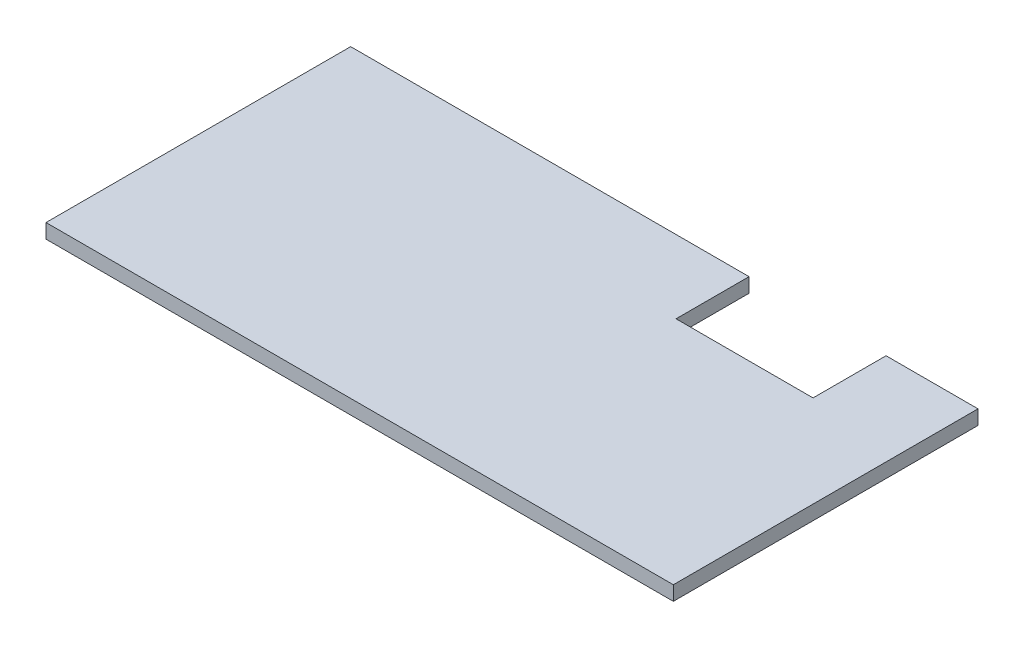
ISO-10303-21;
HEADER;
FILE_DESCRIPTION(('STEP AP214'),'2;1');
FILE_NAME('part.step','',(''),(''),'','','');
FILE_SCHEMA(('AUTOMOTIVE_DESIGN { 1 0 10303 214 1 1 1 1 }'));
ENDSEC;
DATA;
#1=APPLICATION_CONTEXT('core data for automotive mechanical design processes');
#2=APPLICATION_PROTOCOL_DEFINITION('international standard','automotive_design',2000,#1);
#3=PRODUCT_CONTEXT('',#1,'mechanical');
#4=PRODUCT('Part','Part','',(#3));
#5=PRODUCT_RELATED_PRODUCT_CATEGORY('part','',(#4));
#6=PRODUCT_DEFINITION_FORMATION('','',#4);
#7=PRODUCT_DEFINITION_CONTEXT('part definition',#1,'design');
#8=PRODUCT_DEFINITION('design','',#6,#7);
#9=PRODUCT_DEFINITION_SHAPE('','',#8);
#10=(LENGTH_UNIT() NAMED_UNIT(*) SI_UNIT(.MILLI.,.METRE.));
#11=(NAMED_UNIT(*) PLANE_ANGLE_UNIT() SI_UNIT($,.RADIAN.));
#12=(NAMED_UNIT(*) SI_UNIT($,.STERADIAN.) SOLID_ANGLE_UNIT());
#13=UNCERTAINTY_MEASURE_WITH_UNIT(LENGTH_MEASURE(1.E-05),#10,'distance_accuracy_value','');
#14=(GEOMETRIC_REPRESENTATION_CONTEXT(3) GLOBAL_UNCERTAINTY_ASSIGNED_CONTEXT((#13)) GLOBAL_UNIT_ASSIGNED_CONTEXT((#10,
#11,#12)) REPRESENTATION_CONTEXT('',''));
#15=CARTESIAN_POINT('',(0.,0.,0.));
#16=DIRECTION('',(0.,0.,1.));
#17=DIRECTION('',(1.,0.,0.));
#18=AXIS2_PLACEMENT_3D('',#15,#16,#17);
#19=CARTESIAN_POINT('',(-29.8,1.6,-24.52));
#20=DIRECTION('',(0.,0.,1.));
#21=DIRECTION('',(1.,0.,0.));
#22=AXIS2_PLACEMENT_3D('',#19,#20,#21);
#23=PLANE('',#22);
#24=DIRECTION('',(-1.,0.,0.));
#25=VECTOR('',#24,1.);
#26=CARTESIAN_POINT('',(-29.8,0.,-24.52));
#27=LINE('',#26,#25);
#28=CARTESIAN_POINT('',(39.8,0.,-24.52));
#29=VERTEX_POINT('',#28);
#30=CARTESIAN_POINT('',(29.6,0.,-24.52));
#31=VERTEX_POINT('',#30);
#32=EDGE_CURVE('E127',#29,#31,#27,.T.);
#33=ORIENTED_EDGE('',*,*,#32,.T.);
#34=DIRECTION('',(0.,1.,0.));
#35=VECTOR('',#34,1.);
#36=CARTESIAN_POINT('',(29.6,-8.4,-24.52));
#37=LINE('',#36,#35);
#38=CARTESIAN_POINT('',(29.6,1.6,-24.52));
#39=VERTEX_POINT('',#38);
#40=EDGE_CURVE('E113',#31,#39,#37,.T.);
#41=ORIENTED_EDGE('',*,*,#40,.T.);
#42=DIRECTION('',(-1.,0.,0.));
#43=VECTOR('',#42,1.);
#44=CARTESIAN_POINT('',(-29.8,1.6,-24.52));
#45=LINE('',#44,#43);
#46=CARTESIAN_POINT('',(39.8,1.6,-24.52));
#47=VERTEX_POINT('',#46);
#48=EDGE_CURVE('E125',#47,#39,#45,.T.);
#49=ORIENTED_EDGE('',*,*,#48,.F.);
#50=DIRECTION('',(0.,-1.,0.));
#51=VECTOR('',#50,1.);
#52=CARTESIAN_POINT('',(39.8,1.6,-24.52));
#53=LINE('',#52,#51);
#54=EDGE_CURVE('E137',#47,#29,#53,.T.);
#55=ORIENTED_EDGE('',*,*,#54,.T.);
#56=EDGE_LOOP('',(#33,#41,#49,#55));
#57=FACE_BOUND('',#56,.T.);
#58=ADVANCED_FACE('F35',(#57),#23,.F.);
#59=CARTESIAN_POINT('',(-29.8,1.6,-24.52));
#60=DIRECTION('',(1.,0.,0.));
#61=DIRECTION('',(0.,0.,-1.));
#62=AXIS2_PLACEMENT_3D('',#59,#60,#61);
#63=PLANE('',#62);
#64=DIRECTION('',(0.,0.,1.));
#65=VECTOR('',#64,1.);
#66=CARTESIAN_POINT('',(-29.8,0.,-24.52));
#67=LINE('',#66,#65);
#68=CARTESIAN_POINT('',(-29.8,0.,-24.52));
#69=VERTEX_POINT('',#68);
#70=CARTESIAN_POINT('',(-29.8,0.,9.28));
#71=VERTEX_POINT('',#70);
#72=EDGE_CURVE('E142',#69,#71,#67,.T.);
#73=ORIENTED_EDGE('',*,*,#72,.T.);
#74=DIRECTION('',(0.,-1.,0.));
#75=VECTOR('',#74,1.);
#76=CARTESIAN_POINT('',(-29.8,1.6,9.28));
#77=LINE('',#76,#75);
#78=CARTESIAN_POINT('',(-29.8,1.6,9.28));
#79=VERTEX_POINT('',#78);
#80=EDGE_CURVE('E155',#79,#71,#77,.T.);
#81=ORIENTED_EDGE('',*,*,#80,.F.);
#82=DIRECTION('',(0.,0.,1.));
#83=VECTOR('',#82,1.);
#84=CARTESIAN_POINT('',(-29.8,1.6,-24.52));
#85=LINE('',#84,#83);
#86=CARTESIAN_POINT('',(-29.8,1.6,-24.52));
#87=VERTEX_POINT('',#86);
#88=EDGE_CURVE('E149',#87,#79,#85,.T.);
#89=ORIENTED_EDGE('',*,*,#88,.F.);
#90=DIRECTION('',(0.,-1.,0.));
#91=VECTOR('',#90,1.);
#92=CARTESIAN_POINT('',(-29.8,1.6,-24.52));
#93=LINE('',#92,#91);
#94=EDGE_CURVE('E135',#87,#69,#93,.T.);
#95=ORIENTED_EDGE('',*,*,#94,.T.);
#96=EDGE_LOOP('',(#73,#81,#89,#95));
#97=FACE_BOUND('',#96,.T.);
#98=ADVANCED_FACE('F37',(#97),#63,.F.);
#99=CARTESIAN_POINT('',(-29.8,1.6,9.28));
#100=DIRECTION('',(0.,0.,-1.));
#101=DIRECTION('',(-1.,0.,0.));
#102=AXIS2_PLACEMENT_3D('',#99,#100,#101);
#103=PLANE('',#102);
#104=DIRECTION('',(1.,0.,0.));
#105=VECTOR('',#104,1.);
#106=CARTESIAN_POINT('',(-29.8,0.,9.28));
#107=LINE('',#106,#105);
#108=CARTESIAN_POINT('',(39.8,0.,9.28));
#109=VERTEX_POINT('',#108);
#110=EDGE_CURVE('E145',#71,#109,#107,.T.);
#111=ORIENTED_EDGE('',*,*,#110,.T.);
#112=DIRECTION('',(0.,-1.,0.));
#113=VECTOR('',#112,1.);
#114=CARTESIAN_POINT('',(39.8,1.6,9.28));
#115=LINE('',#114,#113);
#116=CARTESIAN_POINT('',(39.8,1.6,9.28));
#117=VERTEX_POINT('',#116);
#118=EDGE_CURVE('E152',#117,#109,#115,.T.);
#119=ORIENTED_EDGE('',*,*,#118,.F.);
#120=DIRECTION('',(1.,0.,0.));
#121=VECTOR('',#120,1.);
#122=CARTESIAN_POINT('',(-29.8,1.6,9.28));
#123=LINE('',#122,#121);
#124=EDGE_CURVE('E89',#79,#117,#123,.T.);
#125=ORIENTED_EDGE('',*,*,#124,.F.);
#126=ORIENTED_EDGE('',*,*,#80,.T.);
#127=EDGE_LOOP('',(#111,#119,#125,#126));
#128=FACE_BOUND('',#127,.T.);
#129=ADVANCED_FACE('F172',(#128),#103,.F.);
#130=CARTESIAN_POINT('',(39.8,1.6,-24.52));
#131=DIRECTION('',(-1.,0.,0.));
#132=DIRECTION('',(0.,0.,1.));
#133=AXIS2_PLACEMENT_3D('',#130,#131,#132);
#134=PLANE('',#133);
#135=DIRECTION('',(0.,0.,-1.));
#136=VECTOR('',#135,1.);
#137=CARTESIAN_POINT('',(39.8,0.,-24.52));
#138=LINE('',#137,#136);
#139=EDGE_CURVE('E147',#109,#29,#138,.T.);
#140=ORIENTED_EDGE('',*,*,#139,.T.);
#141=ORIENTED_EDGE('',*,*,#54,.F.);
#142=DIRECTION('',(0.,0.,-1.));
#143=VECTOR('',#142,1.);
#144=CARTESIAN_POINT('',(39.8,1.6,-24.52));
#145=LINE('',#144,#143);
#146=EDGE_CURVE('E133',#117,#47,#145,.T.);
#147=ORIENTED_EDGE('',*,*,#146,.F.);
#148=ORIENTED_EDGE('',*,*,#118,.T.);
#149=EDGE_LOOP('',(#140,#141,#147,#148));
#150=FACE_BOUND('',#149,.T.);
#151=ADVANCED_FACE('F175',(#150),#134,.F.);
#152=CARTESIAN_POINT('',(14.4,1.6,-24.52));
#153=VERTEX_POINT('',#152);
#154=EDGE_CURVE('E59',#153,#87,#45,.T.);
#155=ORIENTED_EDGE('',*,*,#154,.F.);
#156=DIRECTION('',(0.,1.,0.));
#157=VECTOR('',#156,1.);
#158=CARTESIAN_POINT('',(14.4,-8.4,-24.52));
#159=LINE('',#158,#157);
#160=CARTESIAN_POINT('',(14.4,0.,-24.52));
#161=VERTEX_POINT('',#160);
#162=EDGE_CURVE('E128',#161,#153,#159,.T.);
#163=ORIENTED_EDGE('',*,*,#162,.F.);
#164=EDGE_CURVE('E81',#161,#69,#27,.T.);
#165=ORIENTED_EDGE('',*,*,#164,.T.);
#166=ORIENTED_EDGE('',*,*,#94,.F.);
#167=EDGE_LOOP('',(#155,#163,#165,#166));
#168=FACE_BOUND('',#167,.T.);
#169=ADVANCED_FACE('F178',(#168),#23,.F.);
#170=CARTESIAN_POINT('',(0.,1.6,0.));
#171=DIRECTION('',(0.,1.,0.));
#172=DIRECTION('',(0.,0.,1.));
#173=AXIS2_PLACEMENT_3D('',#170,#171,#172);
#174=PLANE('',#173);
#175=DIRECTION('',(0.,0.,-1.));
#176=VECTOR('',#175,1.);
#177=CARTESIAN_POINT('',(29.6,1.6,-24.52));
#178=LINE('',#177,#176);
#179=CARTESIAN_POINT('',(29.6,1.6,-16.42));
#180=VERTEX_POINT('',#179);
#181=EDGE_CURVE('E110',#180,#39,#178,.T.);
#182=ORIENTED_EDGE('',*,*,#181,.F.);
#183=DIRECTION('',(1.,0.,0.));
#184=VECTOR('',#183,1.);
#185=CARTESIAN_POINT('',(29.6,1.6,-16.42));
#186=LINE('',#185,#184);
#187=CARTESIAN_POINT('',(14.4,1.6,-16.42));
#188=VERTEX_POINT('',#187);
#189=EDGE_CURVE('E129',#188,#180,#186,.T.);
#190=ORIENTED_EDGE('',*,*,#189,.F.);
#191=DIRECTION('',(0.,0.,1.));
#192=VECTOR('',#191,1.);
#193=CARTESIAN_POINT('',(14.4,1.6,-24.52));
#194=LINE('',#193,#192);
#195=EDGE_CURVE('E119',#153,#188,#194,.T.);
#196=ORIENTED_EDGE('',*,*,#195,.F.);
#197=ORIENTED_EDGE('',*,*,#154,.T.);
#198=ORIENTED_EDGE('',*,*,#88,.T.);
#199=ORIENTED_EDGE('',*,*,#124,.T.);
#200=ORIENTED_EDGE('',*,*,#146,.T.);
#201=ORIENTED_EDGE('',*,*,#48,.T.);
#202=EDGE_LOOP('',(#182,#190,#196,#197,#198,#199,#200,#201));
#203=FACE_BOUND('',#202,.T.);
#204=ADVANCED_FACE('F131',(#203),#174,.T.);
#205=CARTESIAN_POINT('',(0.,0.,0.));
#206=DIRECTION('',(0.,1.,0.));
#207=DIRECTION('',(0.,0.,1.));
#208=AXIS2_PLACEMENT_3D('',#205,#206,#207);
#209=PLANE('',#208);
#210=DIRECTION('',(1.,0.,0.));
#211=VECTOR('',#210,1.);
#212=CARTESIAN_POINT('',(0.,0.,-16.42));
#213=LINE('',#212,#211);
#214=CARTESIAN_POINT('',(14.4,0.,-16.42));
#215=VERTEX_POINT('',#214);
#216=CARTESIAN_POINT('',(29.6,0.,-16.42));
#217=VERTEX_POINT('',#216);
#218=EDGE_CURVE('E43',#215,#217,#213,.T.);
#219=ORIENTED_EDGE('',*,*,#218,.T.);
#220=DIRECTION('',(0.,0.,-1.));
#221=VECTOR('',#220,1.);
#222=CARTESIAN_POINT('',(29.6,0.,0.));
#223=LINE('',#222,#221);
#224=EDGE_CURVE('E11',#217,#31,#223,.T.);
#225=ORIENTED_EDGE('',*,*,#224,.T.);
#226=ORIENTED_EDGE('',*,*,#32,.F.);
#227=ORIENTED_EDGE('',*,*,#139,.F.);
#228=ORIENTED_EDGE('',*,*,#110,.F.);
#229=ORIENTED_EDGE('',*,*,#72,.F.);
#230=ORIENTED_EDGE('',*,*,#164,.F.);
#231=DIRECTION('',(0.,0.,1.));
#232=VECTOR('',#231,1.);
#233=CARTESIAN_POINT('',(14.4,0.,0.));
#234=LINE('',#233,#232);
#235=EDGE_CURVE('E157',#161,#215,#234,.T.);
#236=ORIENTED_EDGE('',*,*,#235,.T.);
#237=EDGE_LOOP('',(#219,#225,#226,#227,#228,#229,#230,#236));
#238=FACE_BOUND('',#237,.T.);
#239=ADVANCED_FACE('F161',(#238),#209,.F.);
#240=CARTESIAN_POINT('',(29.6,-8.4,-24.52));
#241=DIRECTION('',(1.,0.,0.));
#242=DIRECTION('',(0.,0.,-1.));
#243=AXIS2_PLACEMENT_3D('',#240,#241,#242);
#244=PLANE('',#243);
#245=DIRECTION('',(0.,1.,0.));
#246=VECTOR('',#245,1.);
#247=CARTESIAN_POINT('',(29.6,-8.4,-16.42));
#248=LINE('',#247,#246);
#249=EDGE_CURVE('E115',#217,#180,#248,.T.);
#250=ORIENTED_EDGE('',*,*,#249,.T.);
#251=ORIENTED_EDGE('',*,*,#181,.T.);
#252=ORIENTED_EDGE('',*,*,#40,.F.);
#253=ORIENTED_EDGE('',*,*,#224,.F.);
#254=EDGE_LOOP('',(#250,#251,#252,#253));
#255=FACE_BOUND('',#254,.T.);
#256=ADVANCED_FACE('F112',(#255),#244,.F.);
#257=CARTESIAN_POINT('',(29.6,-8.4,-16.42));
#258=DIRECTION('',(0.,0.,1.));
#259=DIRECTION('',(1.,0.,0.));
#260=AXIS2_PLACEMENT_3D('',#257,#258,#259);
#261=PLANE('',#260);
#262=DIRECTION('',(0.,1.,0.));
#263=VECTOR('',#262,1.);
#264=CARTESIAN_POINT('',(14.4,-8.4,-16.42));
#265=LINE('',#264,#263);
#266=EDGE_CURVE('E50',#215,#188,#265,.T.);
#267=ORIENTED_EDGE('',*,*,#266,.T.);
#268=ORIENTED_EDGE('',*,*,#189,.T.);
#269=ORIENTED_EDGE('',*,*,#249,.F.);
#270=ORIENTED_EDGE('',*,*,#218,.F.);
#271=EDGE_LOOP('',(#267,#268,#269,#270));
#272=FACE_BOUND('',#271,.T.);
#273=ADVANCED_FACE('F163',(#272),#261,.F.);
#274=CARTESIAN_POINT('',(14.4,-8.4,-24.52));
#275=DIRECTION('',(-1.,0.,0.));
#276=DIRECTION('',(0.,0.,1.));
#277=AXIS2_PLACEMENT_3D('',#274,#275,#276);
#278=PLANE('',#277);
#279=ORIENTED_EDGE('',*,*,#162,.T.);
#280=ORIENTED_EDGE('',*,*,#195,.T.);
#281=ORIENTED_EDGE('',*,*,#266,.F.);
#282=ORIENTED_EDGE('',*,*,#235,.F.);
#283=EDGE_LOOP('',(#279,#280,#281,#282));
#284=FACE_BOUND('',#283,.T.);
#285=ADVANCED_FACE('F179',(#284),#278,.F.);
#286=CLOSED_SHELL('',(#58,#98,#129,#151,#169,#204,#239,#256,#273,#285));
#287=MANIFOLD_SOLID_BREP('B2',#286);
#288=ADVANCED_BREP_SHAPE_REPRESENTATION('',(#18,#287),#14);
#289=SHAPE_DEFINITION_REPRESENTATION(#9,#288);
ENDSEC;
END-ISO-10303-21;
